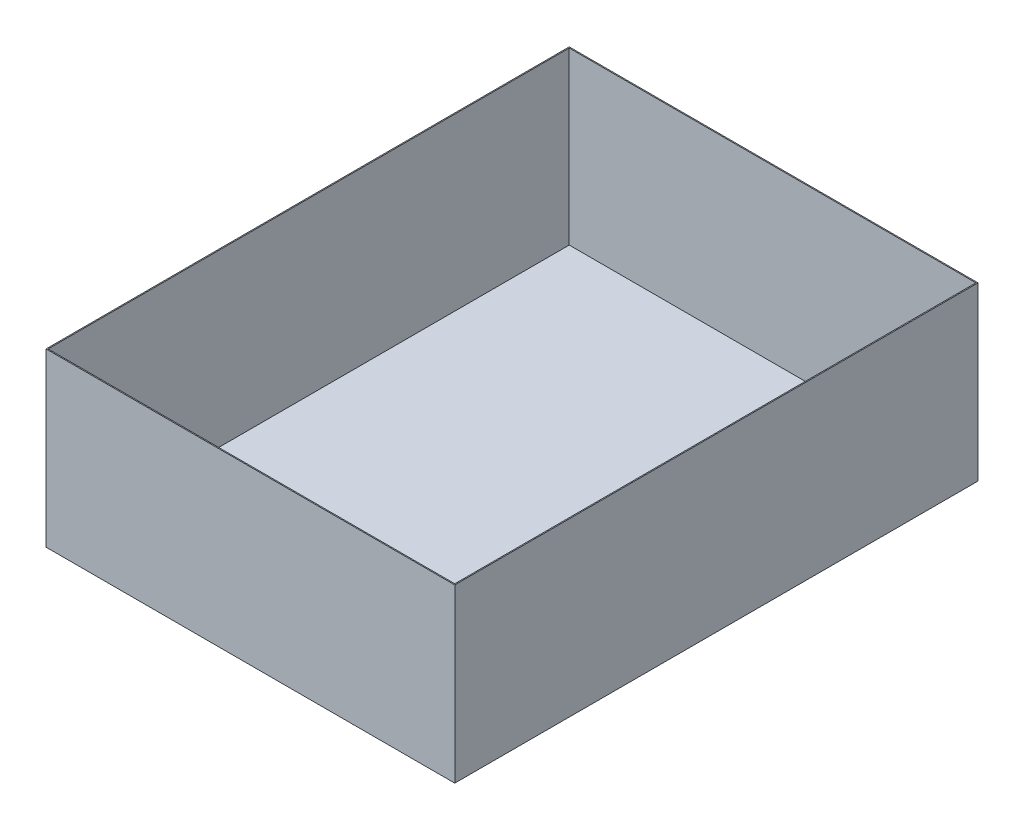
ISO-10303-21;
HEADER;
FILE_DESCRIPTION(('STEP AP214'),'2;1');
FILE_NAME('part.step','',(''),(''),'','','');
FILE_SCHEMA(('AUTOMOTIVE_DESIGN { 1 0 10303 214 1 1 1 1 }'));
ENDSEC;
DATA;
#1=APPLICATION_CONTEXT('core data for automotive mechanical design processes');
#2=APPLICATION_PROTOCOL_DEFINITION('international standard','automotive_design',2000,#1);
#3=PRODUCT_CONTEXT('',#1,'mechanical');
#4=PRODUCT('Part','Part','',(#3));
#5=PRODUCT_RELATED_PRODUCT_CATEGORY('part','',(#4));
#6=PRODUCT_DEFINITION_FORMATION('','',#4);
#7=PRODUCT_DEFINITION_CONTEXT('part definition',#1,'design');
#8=PRODUCT_DEFINITION('design','',#6,#7);
#9=PRODUCT_DEFINITION_SHAPE('','',#8);
#10=(LENGTH_UNIT() NAMED_UNIT(*) SI_UNIT(.MILLI.,.METRE.));
#11=(NAMED_UNIT(*) PLANE_ANGLE_UNIT() SI_UNIT($,.RADIAN.));
#12=(NAMED_UNIT(*) SI_UNIT($,.STERADIAN.) SOLID_ANGLE_UNIT());
#13=UNCERTAINTY_MEASURE_WITH_UNIT(LENGTH_MEASURE(1.E-05),#10,'distance_accuracy_value','');
#14=(GEOMETRIC_REPRESENTATION_CONTEXT(3) GLOBAL_UNCERTAINTY_ASSIGNED_CONTEXT((#13)) GLOBAL_UNIT_ASSIGNED_CONTEXT((#10,
#11,#12)) REPRESENTATION_CONTEXT('',''));
#15=CARTESIAN_POINT('',(0.,0.,0.));
#16=DIRECTION('',(0.,0.,1.));
#17=DIRECTION('',(1.,0.,0.));
#18=AXIS2_PLACEMENT_3D('',#15,#16,#17);
#19=CARTESIAN_POINT('',(0.,0.,0.));
#20=DIRECTION('',(0.,1.,0.));
#21=DIRECTION('',(0.,0.,1.));
#22=AXIS2_PLACEMENT_3D('',#19,#20,#21);
#23=PLANE('',#22);
#24=DIRECTION('',(0.,0.,1.));
#25=VECTOR('',#24,1.);
#26=CARTESIAN_POINT('',(250.,0.,0.));
#27=LINE('',#26,#25);
#28=CARTESIAN_POINT('',(250.,0.,-320.));
#29=VERTEX_POINT('',#28);
#30=CARTESIAN_POINT('',(250.,0.,0.));
#31=VERTEX_POINT('',#30);
#32=EDGE_CURVE('E133',#29,#31,#27,.T.);
#33=ORIENTED_EDGE('',*,*,#32,.F.);
#34=DIRECTION('',(1.,0.,0.));
#35=VECTOR('',#34,1.);
#36=CARTESIAN_POINT('',(0.,0.,-320.));
#37=LINE('',#36,#35);
#38=CARTESIAN_POINT('',(0.,0.,-320.));
#39=VERTEX_POINT('',#38);
#40=EDGE_CURVE('E164',#39,#29,#37,.T.);
#41=ORIENTED_EDGE('',*,*,#40,.F.);
#42=DIRECTION('',(0.,0.,1.));
#43=VECTOR('',#42,1.);
#44=CARTESIAN_POINT('',(0.,0.,0.));
#45=LINE('',#44,#43);
#46=CARTESIAN_POINT('',(0.,0.,0.));
#47=VERTEX_POINT('',#46);
#48=EDGE_CURVE('E166',#39,#47,#45,.T.);
#49=ORIENTED_EDGE('',*,*,#48,.T.);
#50=DIRECTION('',(1.,0.,0.));
#51=VECTOR('',#50,1.);
#52=CARTESIAN_POINT('',(0.,0.,0.));
#53=LINE('',#52,#51);
#54=EDGE_CURVE('E156',#47,#31,#53,.T.);
#55=ORIENTED_EDGE('',*,*,#54,.T.);
#56=EDGE_LOOP('',(#33,#41,#49,#55));
#57=FACE_BOUND('',#56,.T.);
#58=DIRECTION('',(1.,0.,0.));
#59=VECTOR('',#58,1.);
#60=CARTESIAN_POINT('',(0.,0.,-319.365));
#61=LINE('',#60,#59);
#62=CARTESIAN_POINT('',(0.635000000000001,0.,-319.365));
#63=VERTEX_POINT('',#62);
#64=CARTESIAN_POINT('',(249.365,0.,-319.365));
#65=VERTEX_POINT('',#64);
#66=EDGE_CURVE('E150',#63,#65,#61,.T.);
#67=ORIENTED_EDGE('',*,*,#66,.T.);
#68=DIRECTION('',(0.,0.,1.));
#69=VECTOR('',#68,1.);
#70=CARTESIAN_POINT('',(249.365,0.,0.));
#71=LINE('',#70,#69);
#72=CARTESIAN_POINT('',(249.365,0.,-0.635));
#73=VERTEX_POINT('',#72);
#74=EDGE_CURVE('E148',#65,#73,#71,.T.);
#75=ORIENTED_EDGE('',*,*,#74,.T.);
#76=DIRECTION('',(1.,0.,0.));
#77=VECTOR('',#76,1.);
#78=CARTESIAN_POINT('',(0.,0.,-0.635));
#79=LINE('',#78,#77);
#80=CARTESIAN_POINT('',(0.635,0.,-0.635));
#81=VERTEX_POINT('',#80);
#82=EDGE_CURVE('E125',#81,#73,#79,.T.);
#83=ORIENTED_EDGE('',*,*,#82,.F.);
#84=DIRECTION('',(0.,0.,1.));
#85=VECTOR('',#84,1.);
#86=CARTESIAN_POINT('',(0.635,0.,0.));
#87=LINE('',#86,#85);
#88=EDGE_CURVE('E56',#63,#81,#87,.T.);
#89=ORIENTED_EDGE('',*,*,#88,.F.);
#90=EDGE_LOOP('',(#67,#75,#83,#89));
#91=FACE_BOUND('',#90,.T.);
#92=ADVANCED_FACE('F39',(#57,#91),#23,.T.);
#93=CARTESIAN_POINT('',(250.,-105.,0.));
#94=DIRECTION('',(-1.,0.,0.));
#95=DIRECTION('',(0.,0.,1.));
#96=AXIS2_PLACEMENT_3D('',#93,#94,#95);
#97=PLANE('',#96);
#98=ORIENTED_EDGE('',*,*,#32,.T.);
#99=DIRECTION('',(0.,1.,0.));
#100=VECTOR('',#99,1.);
#101=CARTESIAN_POINT('',(250.,-105.,0.));
#102=LINE('',#101,#100);
#103=CARTESIAN_POINT('',(250.,-105.,0.));
#104=VERTEX_POINT('',#103);
#105=EDGE_CURVE('E11',#104,#31,#102,.T.);
#106=ORIENTED_EDGE('',*,*,#105,.F.);
#107=DIRECTION('',(0.,0.,1.));
#108=VECTOR('',#107,1.);
#109=CARTESIAN_POINT('',(250.,-105.,0.));
#110=LINE('',#109,#108);
#111=CARTESIAN_POINT('',(250.,-105.,-320.));
#112=VERTEX_POINT('',#111);
#113=EDGE_CURVE('E65',#112,#104,#110,.T.);
#114=ORIENTED_EDGE('',*,*,#113,.F.);
#115=DIRECTION('',(0.,1.,0.));
#116=VECTOR('',#115,1.);
#117=CARTESIAN_POINT('',(250.,-105.,-320.));
#118=LINE('',#117,#116);
#119=EDGE_CURVE('E43',#112,#29,#118,.T.);
#120=ORIENTED_EDGE('',*,*,#119,.T.);
#121=EDGE_LOOP('',(#98,#106,#114,#120));
#122=FACE_BOUND('',#121,.T.);
#123=ADVANCED_FACE('F41',(#122),#97,.F.);
#124=CARTESIAN_POINT('',(0.,-105.,0.));
#125=DIRECTION('',(0.,0.,1.));
#126=DIRECTION('',(1.,0.,0.));
#127=AXIS2_PLACEMENT_3D('',#124,#125,#126);
#128=PLANE('',#127);
#129=ORIENTED_EDGE('',*,*,#54,.F.);
#130=DIRECTION('',(0.,1.,0.));
#131=VECTOR('',#130,1.);
#132=CARTESIAN_POINT('',(0.,-105.,0.));
#133=LINE('',#132,#131);
#134=CARTESIAN_POINT('',(0.,-105.,0.));
#135=VERTEX_POINT('',#134);
#136=EDGE_CURVE('E48',#135,#47,#133,.T.);
#137=ORIENTED_EDGE('',*,*,#136,.F.);
#138=DIRECTION('',(1.,0.,0.));
#139=VECTOR('',#138,1.);
#140=CARTESIAN_POINT('',(0.,-105.,0.));
#141=LINE('',#140,#139);
#142=EDGE_CURVE('E161',#135,#104,#141,.T.);
#143=ORIENTED_EDGE('',*,*,#142,.T.);
#144=ORIENTED_EDGE('',*,*,#105,.T.);
#145=EDGE_LOOP('',(#129,#137,#143,#144));
#146=FACE_BOUND('',#145,.T.);
#147=ADVANCED_FACE('F180',(#146),#128,.T.);
#148=CARTESIAN_POINT('',(0.,-105.,0.));
#149=DIRECTION('',(-1.,0.,0.));
#150=DIRECTION('',(0.,0.,1.));
#151=AXIS2_PLACEMENT_3D('',#148,#149,#150);
#152=PLANE('',#151);
#153=ORIENTED_EDGE('',*,*,#48,.F.);
#154=DIRECTION('',(0.,1.,0.));
#155=VECTOR('',#154,1.);
#156=CARTESIAN_POINT('',(0.,-105.,-320.));
#157=LINE('',#156,#155);
#158=CARTESIAN_POINT('',(0.,-105.,-320.));
#159=VERTEX_POINT('',#158);
#160=EDGE_CURVE('E171',#159,#39,#157,.T.);
#161=ORIENTED_EDGE('',*,*,#160,.F.);
#162=DIRECTION('',(0.,0.,1.));
#163=VECTOR('',#162,1.);
#164=CARTESIAN_POINT('',(0.,-105.,0.));
#165=LINE('',#164,#163);
#166=EDGE_CURVE('E158',#159,#135,#165,.T.);
#167=ORIENTED_EDGE('',*,*,#166,.T.);
#168=ORIENTED_EDGE('',*,*,#136,.T.);
#169=EDGE_LOOP('',(#153,#161,#167,#168));
#170=FACE_BOUND('',#169,.T.);
#171=ADVANCED_FACE('F182',(#170),#152,.T.);
#172=CARTESIAN_POINT('',(0.,-105.,-320.));
#173=DIRECTION('',(0.,0.,1.));
#174=DIRECTION('',(1.,0.,0.));
#175=AXIS2_PLACEMENT_3D('',#172,#173,#174);
#176=PLANE('',#175);
#177=ORIENTED_EDGE('',*,*,#40,.T.);
#178=ORIENTED_EDGE('',*,*,#119,.F.);
#179=DIRECTION('',(1.,0.,0.));
#180=VECTOR('',#179,1.);
#181=CARTESIAN_POINT('',(0.,-105.,-320.));
#182=LINE('',#181,#180);
#183=EDGE_CURVE('E90',#159,#112,#182,.T.);
#184=ORIENTED_EDGE('',*,*,#183,.F.);
#185=ORIENTED_EDGE('',*,*,#160,.T.);
#186=EDGE_LOOP('',(#177,#178,#184,#185));
#187=FACE_BOUND('',#186,.T.);
#188=ADVANCED_FACE('F185',(#187),#176,.F.);
#189=CARTESIAN_POINT('',(0.,-105.,0.));
#190=DIRECTION('',(0.,1.,0.));
#191=DIRECTION('',(0.,0.,1.));
#192=AXIS2_PLACEMENT_3D('',#189,#190,#191);
#193=PLANE('',#192);
#194=ORIENTED_EDGE('',*,*,#113,.T.);
#195=ORIENTED_EDGE('',*,*,#142,.F.);
#196=ORIENTED_EDGE('',*,*,#166,.F.);
#197=ORIENTED_EDGE('',*,*,#183,.T.);
#198=EDGE_LOOP('',(#194,#195,#196,#197));
#199=FACE_BOUND('',#198,.T.);
#200=ADVANCED_FACE('F183',(#199),#193,.F.);
#201=CARTESIAN_POINT('',(249.365,-105.,0.));
#202=DIRECTION('',(-1.,0.,0.));
#203=DIRECTION('',(0.,0.,1.));
#204=AXIS2_PLACEMENT_3D('',#201,#202,#203);
#205=PLANE('',#204);
#206=ORIENTED_EDGE('',*,*,#74,.F.);
#207=DIRECTION('',(0.,1.,0.));
#208=VECTOR('',#207,1.);
#209=CARTESIAN_POINT('',(249.365,-105.,-319.365));
#210=LINE('',#209,#208);
#211=CARTESIAN_POINT('',(249.365,-104.365,-319.365));
#212=VERTEX_POINT('',#211);
#213=EDGE_CURVE('E120',#212,#65,#210,.T.);
#214=ORIENTED_EDGE('',*,*,#213,.F.);
#215=DIRECTION('',(0.,0.,1.));
#216=VECTOR('',#215,1.);
#217=CARTESIAN_POINT('',(249.365,-104.365,0.));
#218=LINE('',#217,#216);
#219=CARTESIAN_POINT('',(249.365,-104.365,-0.635));
#220=VERTEX_POINT('',#219);
#221=EDGE_CURVE('E114',#212,#220,#218,.T.);
#222=ORIENTED_EDGE('',*,*,#221,.T.);
#223=DIRECTION('',(0.,1.,0.));
#224=VECTOR('',#223,1.);
#225=CARTESIAN_POINT('',(249.365,-105.,-0.635));
#226=LINE('',#225,#224);
#227=EDGE_CURVE('E118',#220,#73,#226,.T.);
#228=ORIENTED_EDGE('',*,*,#227,.T.);
#229=EDGE_LOOP('',(#206,#214,#222,#228));
#230=FACE_BOUND('',#229,.T.);
#231=ADVANCED_FACE('F117',(#230),#205,.T.);
#232=CARTESIAN_POINT('',(0.,-105.,-0.635));
#233=DIRECTION('',(0.,0.,1.));
#234=DIRECTION('',(1.,0.,0.));
#235=AXIS2_PLACEMENT_3D('',#232,#233,#234);
#236=PLANE('',#235);
#237=ORIENTED_EDGE('',*,*,#82,.T.);
#238=ORIENTED_EDGE('',*,*,#227,.F.);
#239=DIRECTION('',(1.,0.,0.));
#240=VECTOR('',#239,1.);
#241=CARTESIAN_POINT('',(0.,-104.365,-0.635));
#242=LINE('',#241,#240);
#243=CARTESIAN_POINT('',(0.635,-104.365,-0.635));
#244=VERTEX_POINT('',#243);
#245=EDGE_CURVE('E130',#244,#220,#242,.T.);
#246=ORIENTED_EDGE('',*,*,#245,.F.);
#247=DIRECTION('',(0.,1.,0.));
#248=VECTOR('',#247,1.);
#249=CARTESIAN_POINT('',(0.635,-105.,-0.635));
#250=LINE('',#249,#248);
#251=EDGE_CURVE('E134',#244,#81,#250,.T.);
#252=ORIENTED_EDGE('',*,*,#251,.T.);
#253=EDGE_LOOP('',(#237,#238,#246,#252));
#254=FACE_BOUND('',#253,.T.);
#255=ADVANCED_FACE('F129',(#254),#236,.F.);
#256=CARTESIAN_POINT('',(0.635,-105.,0.));
#257=DIRECTION('',(-1.,0.,0.));
#258=DIRECTION('',(0.,0.,1.));
#259=AXIS2_PLACEMENT_3D('',#256,#257,#258);
#260=PLANE('',#259);
#261=ORIENTED_EDGE('',*,*,#88,.T.);
#262=ORIENTED_EDGE('',*,*,#251,.F.);
#263=DIRECTION('',(0.,0.,1.));
#264=VECTOR('',#263,1.);
#265=CARTESIAN_POINT('',(0.635,-104.365,0.));
#266=LINE('',#265,#264);
#267=CARTESIAN_POINT('',(0.635000000000001,-104.365,-319.365));
#268=VERTEX_POINT('',#267);
#269=EDGE_CURVE('E139',#268,#244,#266,.T.);
#270=ORIENTED_EDGE('',*,*,#269,.F.);
#271=DIRECTION('',(0.,1.,0.));
#272=VECTOR('',#271,1.);
#273=CARTESIAN_POINT('',(0.635000000000001,-105.,-319.365));
#274=LINE('',#273,#272);
#275=EDGE_CURVE('E141',#268,#63,#274,.T.);
#276=ORIENTED_EDGE('',*,*,#275,.T.);
#277=EDGE_LOOP('',(#261,#262,#270,#276));
#278=FACE_BOUND('',#277,.T.);
#279=ADVANCED_FACE('F235',(#278),#260,.F.);
#280=CARTESIAN_POINT('',(0.,-105.,-319.365));
#281=DIRECTION('',(0.,0.,1.));
#282=DIRECTION('',(1.,0.,0.));
#283=AXIS2_PLACEMENT_3D('',#280,#281,#282);
#284=PLANE('',#283);
#285=ORIENTED_EDGE('',*,*,#66,.F.);
#286=ORIENTED_EDGE('',*,*,#275,.F.);
#287=DIRECTION('',(1.,0.,0.));
#288=VECTOR('',#287,1.);
#289=CARTESIAN_POINT('',(0.,-104.365,-319.365));
#290=LINE('',#289,#288);
#291=EDGE_CURVE('E124',#268,#212,#290,.T.);
#292=ORIENTED_EDGE('',*,*,#291,.T.);
#293=ORIENTED_EDGE('',*,*,#213,.T.);
#294=EDGE_LOOP('',(#285,#286,#292,#293));
#295=FACE_BOUND('',#294,.T.);
#296=ADVANCED_FACE('F244',(#295),#284,.T.);
#297=CARTESIAN_POINT('',(0.,-104.365,0.));
#298=DIRECTION('',(0.,1.,0.));
#299=DIRECTION('',(0.,0.,1.));
#300=AXIS2_PLACEMENT_3D('',#297,#298,#299);
#301=PLANE('',#300);
#302=ORIENTED_EDGE('',*,*,#221,.F.);
#303=ORIENTED_EDGE('',*,*,#291,.F.);
#304=ORIENTED_EDGE('',*,*,#269,.T.);
#305=ORIENTED_EDGE('',*,*,#245,.T.);
#306=EDGE_LOOP('',(#302,#303,#304,#305));
#307=FACE_BOUND('',#306,.T.);
#308=ADVANCED_FACE('F137',(#307),#301,.T.);
#309=CLOSED_SHELL('',(#92,#123,#147,#171,#188,#200,#231,#255,#279,#296,#308));
#310=MANIFOLD_SOLID_BREP('B2',#309);
#311=ADVANCED_BREP_SHAPE_REPRESENTATION('',(#18,#310),#14);
#312=SHAPE_DEFINITION_REPRESENTATION(#9,#311);
ENDSEC;
END-ISO-10303-21;
